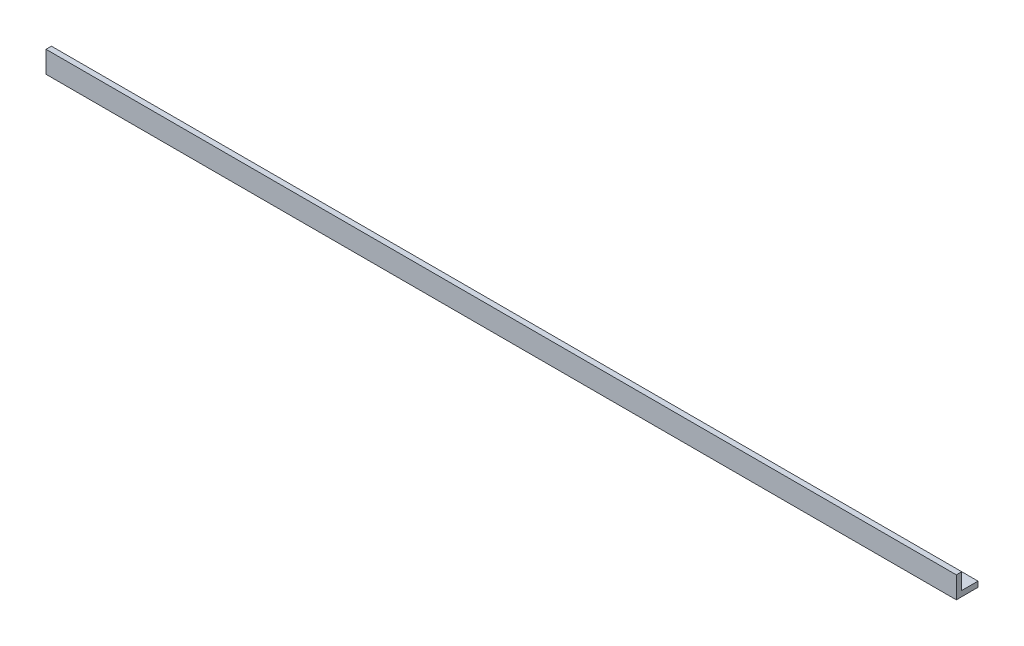
ISO-10303-21;
HEADER;
FILE_DESCRIPTION(('STEP AP214'),'2;1');
FILE_NAME('part.step','',(''),(''),'','','');
FILE_SCHEMA(('AUTOMOTIVE_DESIGN { 1 0 10303 214 1 1 1 1 }'));
ENDSEC;
DATA;
#1=APPLICATION_CONTEXT('core data for automotive mechanical design processes');
#2=APPLICATION_PROTOCOL_DEFINITION('international standard','automotive_design',2000,#1);
#3=PRODUCT_CONTEXT('',#1,'mechanical');
#4=PRODUCT('Part','Part','',(#3));
#5=PRODUCT_RELATED_PRODUCT_CATEGORY('part','',(#4));
#6=PRODUCT_DEFINITION_FORMATION('','',#4);
#7=PRODUCT_DEFINITION_CONTEXT('part definition',#1,'design');
#8=PRODUCT_DEFINITION('design','',#6,#7);
#9=PRODUCT_DEFINITION_SHAPE('','',#8);
#10=(LENGTH_UNIT() NAMED_UNIT(*) SI_UNIT(.MILLI.,.METRE.));
#11=(NAMED_UNIT(*) PLANE_ANGLE_UNIT() SI_UNIT($,.RADIAN.));
#12=(NAMED_UNIT(*) SI_UNIT($,.STERADIAN.) SOLID_ANGLE_UNIT());
#13=UNCERTAINTY_MEASURE_WITH_UNIT(LENGTH_MEASURE(1.E-05),#10,'distance_accuracy_value','');
#14=(GEOMETRIC_REPRESENTATION_CONTEXT(3) GLOBAL_UNCERTAINTY_ASSIGNED_CONTEXT((#13)) GLOBAL_UNIT_ASSIGNED_CONTEXT((#10,
#11,#12)) REPRESENTATION_CONTEXT('',''));
#15=CARTESIAN_POINT('',(0.,0.,0.));
#16=DIRECTION('',(0.,0.,1.));
#17=DIRECTION('',(1.,0.,0.));
#18=AXIS2_PLACEMENT_3D('',#15,#16,#17);
#19=CARTESIAN_POINT('',(-533.4,0.,-25.4));
#20=DIRECTION('',(0.,0.,1.));
#21=DIRECTION('',(1.,0.,0.));
#22=AXIS2_PLACEMENT_3D('',#19,#20,#21);
#23=PLANE('',#22);
#24=DIRECTION('',(1.,0.,0.));
#25=VECTOR('',#24,1.);
#26=CARTESIAN_POINT('',(-533.4,6.35,-25.4));
#27=LINE('',#26,#25);
#28=CARTESIAN_POINT('',(-533.4,6.35,-25.4));
#29=VERTEX_POINT('',#28);
#30=CARTESIAN_POINT('',(533.4,6.35,-25.4));
#31=VERTEX_POINT('',#30);
#32=EDGE_CURVE('E38',#29,#31,#27,.T.);
#33=ORIENTED_EDGE('',*,*,#32,.T.);
#34=DIRECTION('',(0.,-1.,0.));
#35=VECTOR('',#34,1.);
#36=CARTESIAN_POINT('',(533.4,0.,-25.4));
#37=LINE('',#36,#35);
#38=CARTESIAN_POINT('',(533.4,0.,-25.4));
#39=VERTEX_POINT('',#38);
#40=EDGE_CURVE('E90',#31,#39,#37,.T.);
#41=ORIENTED_EDGE('',*,*,#40,.T.);
#42=DIRECTION('',(1.,0.,0.));
#43=VECTOR('',#42,1.);
#44=CARTESIAN_POINT('',(-533.4,0.,-25.4));
#45=LINE('',#44,#43);
#46=CARTESIAN_POINT('',(-533.4,0.,-25.4));
#47=VERTEX_POINT('',#46);
#48=EDGE_CURVE('E11',#47,#39,#45,.T.);
#49=ORIENTED_EDGE('',*,*,#48,.F.);
#50=DIRECTION('',(0.,-1.,0.));
#51=VECTOR('',#50,1.);
#52=CARTESIAN_POINT('',(-533.4,0.,-25.4));
#53=LINE('',#52,#51);
#54=EDGE_CURVE('E51',#29,#47,#53,.T.);
#55=ORIENTED_EDGE('',*,*,#54,.F.);
#56=EDGE_LOOP('',(#33,#41,#49,#55));
#57=FACE_BOUND('',#56,.T.);
#58=ADVANCED_FACE('F35',(#57),#23,.F.);
#59=CARTESIAN_POINT('',(-533.4,0.,0.));
#60=DIRECTION('',(0.,-1.,0.));
#61=DIRECTION('',(0.,0.,-1.));
#62=AXIS2_PLACEMENT_3D('',#59,#60,#61);
#63=PLANE('',#62);
#64=ORIENTED_EDGE('',*,*,#48,.T.);
#65=DIRECTION('',(0.,0.,-1.));
#66=VECTOR('',#65,1.);
#67=CARTESIAN_POINT('',(533.4,0.,0.));
#68=LINE('',#67,#66);
#69=CARTESIAN_POINT('',(533.4,0.,0.));
#70=VERTEX_POINT('',#69);
#71=EDGE_CURVE('E104',#70,#39,#68,.T.);
#72=ORIENTED_EDGE('',*,*,#71,.F.);
#73=DIRECTION('',(1.,0.,0.));
#74=VECTOR('',#73,1.);
#75=CARTESIAN_POINT('',(-533.4,0.,0.));
#76=LINE('',#75,#74);
#77=CARTESIAN_POINT('',(-533.4,0.,0.));
#78=VERTEX_POINT('',#77);
#79=EDGE_CURVE('E43',#78,#70,#76,.T.);
#80=ORIENTED_EDGE('',*,*,#79,.F.);
#81=DIRECTION('',(0.,0.,-1.));
#82=VECTOR('',#81,1.);
#83=CARTESIAN_POINT('',(-533.4,0.,0.));
#84=LINE('',#83,#82);
#85=EDGE_CURVE('E95',#78,#47,#84,.T.);
#86=ORIENTED_EDGE('',*,*,#85,.T.);
#87=EDGE_LOOP('',(#64,#72,#80,#86));
#88=FACE_BOUND('',#87,.T.);
#89=ADVANCED_FACE('F144',(#88),#63,.T.);
#90=CARTESIAN_POINT('',(-533.4,0.,0.));
#91=DIRECTION('',(0.,0.,1.));
#92=DIRECTION('',(1.,0.,0.));
#93=AXIS2_PLACEMENT_3D('',#90,#91,#92);
#94=PLANE('',#93);
#95=ORIENTED_EDGE('',*,*,#79,.T.);
#96=DIRECTION('',(0.,-1.,0.));
#97=VECTOR('',#96,1.);
#98=CARTESIAN_POINT('',(533.4,0.,0.));
#99=LINE('',#98,#97);
#100=CARTESIAN_POINT('',(533.4,25.4,0.));
#101=VERTEX_POINT('',#100);
#102=EDGE_CURVE('E115',#101,#70,#99,.T.);
#103=ORIENTED_EDGE('',*,*,#102,.F.);
#104=DIRECTION('',(1.,0.,0.));
#105=VECTOR('',#104,1.);
#106=CARTESIAN_POINT('',(-533.4,25.4,0.));
#107=LINE('',#106,#105);
#108=CARTESIAN_POINT('',(-533.4,25.4,0.));
#109=VERTEX_POINT('',#108);
#110=EDGE_CURVE('E129',#109,#101,#107,.T.);
#111=ORIENTED_EDGE('',*,*,#110,.F.);
#112=DIRECTION('',(0.,-1.,0.));
#113=VECTOR('',#112,1.);
#114=CARTESIAN_POINT('',(-533.4,0.,0.));
#115=LINE('',#114,#113);
#116=EDGE_CURVE('E125',#109,#78,#115,.T.);
#117=ORIENTED_EDGE('',*,*,#116,.T.);
#118=EDGE_LOOP('',(#95,#103,#111,#117));
#119=FACE_BOUND('',#118,.T.);
#120=ADVANCED_FACE('F143',(#119),#94,.T.);
#121=CARTESIAN_POINT('',(-533.4,25.4,0.));
#122=DIRECTION('',(0.,-1.,0.));
#123=DIRECTION('',(0.,0.,-1.));
#124=AXIS2_PLACEMENT_3D('',#121,#122,#123);
#125=PLANE('',#124);
#126=ORIENTED_EDGE('',*,*,#110,.T.);
#127=DIRECTION('',(0.,0.,-1.));
#128=VECTOR('',#127,1.);
#129=CARTESIAN_POINT('',(533.4,25.4,0.));
#130=LINE('',#129,#128);
#131=CARTESIAN_POINT('',(533.4,25.4,-6.35));
#132=VERTEX_POINT('',#131);
#133=EDGE_CURVE('E110',#101,#132,#130,.T.);
#134=ORIENTED_EDGE('',*,*,#133,.T.);
#135=DIRECTION('',(1.,0.,0.));
#136=VECTOR('',#135,1.);
#137=CARTESIAN_POINT('',(-533.4,25.4,-6.35));
#138=LINE('',#137,#136);
#139=CARTESIAN_POINT('',(-533.4,25.4,-6.35));
#140=VERTEX_POINT('',#139);
#141=EDGE_CURVE('E131',#140,#132,#138,.T.);
#142=ORIENTED_EDGE('',*,*,#141,.F.);
#143=DIRECTION('',(0.,0.,-1.));
#144=VECTOR('',#143,1.);
#145=CARTESIAN_POINT('',(-533.4,25.4,0.));
#146=LINE('',#145,#144);
#147=EDGE_CURVE('E123',#109,#140,#146,.T.);
#148=ORIENTED_EDGE('',*,*,#147,.F.);
#149=EDGE_LOOP('',(#126,#134,#142,#148));
#150=FACE_BOUND('',#149,.T.);
#151=ADVANCED_FACE('F139',(#150),#125,.F.);
#152=CARTESIAN_POINT('',(-533.4,0.,-6.35));
#153=DIRECTION('',(0.,0.,1.));
#154=DIRECTION('',(1.,0.,0.));
#155=AXIS2_PLACEMENT_3D('',#152,#153,#154);
#156=PLANE('',#155);
#157=ORIENTED_EDGE('',*,*,#141,.T.);
#158=DIRECTION('',(0.,-1.,0.));
#159=VECTOR('',#158,1.);
#160=CARTESIAN_POINT('',(533.4,0.,-6.35));
#161=LINE('',#160,#159);
#162=CARTESIAN_POINT('',(533.4,6.35,-6.35));
#163=VERTEX_POINT('',#162);
#164=EDGE_CURVE('E108',#132,#163,#161,.T.);
#165=ORIENTED_EDGE('',*,*,#164,.T.);
#166=DIRECTION('',(1.,0.,0.));
#167=VECTOR('',#166,1.);
#168=CARTESIAN_POINT('',(-533.4,6.35,-6.35));
#169=LINE('',#168,#167);
#170=CARTESIAN_POINT('',(-533.4,6.35,-6.35));
#171=VERTEX_POINT('',#170);
#172=EDGE_CURVE('E94',#171,#163,#169,.T.);
#173=ORIENTED_EDGE('',*,*,#172,.F.);
#174=DIRECTION('',(0.,-1.,0.));
#175=VECTOR('',#174,1.);
#176=CARTESIAN_POINT('',(-533.4,0.,-6.35));
#177=LINE('',#176,#175);
#178=EDGE_CURVE('E121',#140,#171,#177,.T.);
#179=ORIENTED_EDGE('',*,*,#178,.F.);
#180=EDGE_LOOP('',(#157,#165,#173,#179));
#181=FACE_BOUND('',#180,.T.);
#182=ADVANCED_FACE('F135',(#181),#156,.F.);
#183=CARTESIAN_POINT('',(-533.4,6.35,0.));
#184=DIRECTION('',(0.,-1.,0.));
#185=DIRECTION('',(0.,0.,-1.));
#186=AXIS2_PLACEMENT_3D('',#183,#184,#185);
#187=PLANE('',#186);
#188=ORIENTED_EDGE('',*,*,#172,.T.);
#189=DIRECTION('',(0.,0.,-1.));
#190=VECTOR('',#189,1.);
#191=CARTESIAN_POINT('',(533.4,6.35,0.));
#192=LINE('',#191,#190);
#193=EDGE_CURVE('E101',#163,#31,#192,.T.);
#194=ORIENTED_EDGE('',*,*,#193,.T.);
#195=ORIENTED_EDGE('',*,*,#32,.F.);
#196=DIRECTION('',(0.,0.,-1.));
#197=VECTOR('',#196,1.);
#198=CARTESIAN_POINT('',(-533.4,6.35,0.));
#199=LINE('',#198,#197);
#200=EDGE_CURVE('E119',#171,#29,#199,.T.);
#201=ORIENTED_EDGE('',*,*,#200,.F.);
#202=EDGE_LOOP('',(#188,#194,#195,#201));
#203=FACE_BOUND('',#202,.T.);
#204=ADVANCED_FACE('F106',(#203),#187,.F.);
#205=CARTESIAN_POINT('',(-533.4,0.,0.));
#206=DIRECTION('',(1.,0.,0.));
#207=DIRECTION('',(0.,0.,-1.));
#208=AXIS2_PLACEMENT_3D('',#205,#206,#207);
#209=PLANE('',#208);
#210=ORIENTED_EDGE('',*,*,#54,.T.);
#211=ORIENTED_EDGE('',*,*,#85,.F.);
#212=ORIENTED_EDGE('',*,*,#116,.F.);
#213=ORIENTED_EDGE('',*,*,#147,.T.);
#214=ORIENTED_EDGE('',*,*,#178,.T.);
#215=ORIENTED_EDGE('',*,*,#200,.T.);
#216=EDGE_LOOP('',(#210,#211,#212,#213,#214,#215));
#217=FACE_BOUND('',#216,.T.);
#218=ADVANCED_FACE('F145',(#217),#209,.F.);
#219=CARTESIAN_POINT('',(533.4,0.,0.));
#220=DIRECTION('',(1.,0.,0.));
#221=DIRECTION('',(0.,0.,-1.));
#222=AXIS2_PLACEMENT_3D('',#219,#220,#221);
#223=PLANE('',#222);
#224=ORIENTED_EDGE('',*,*,#40,.F.);
#225=ORIENTED_EDGE('',*,*,#193,.F.);
#226=ORIENTED_EDGE('',*,*,#164,.F.);
#227=ORIENTED_EDGE('',*,*,#133,.F.);
#228=ORIENTED_EDGE('',*,*,#102,.T.);
#229=ORIENTED_EDGE('',*,*,#71,.T.);
#230=EDGE_LOOP('',(#224,#225,#226,#227,#228,#229));
#231=FACE_BOUND('',#230,.T.);
#232=ADVANCED_FACE('F99',(#231),#223,.T.);
#233=CLOSED_SHELL('',(#58,#89,#120,#151,#182,#204,#218,#232));
#234=MANIFOLD_SOLID_BREP('B2',#233);
#235=ADVANCED_BREP_SHAPE_REPRESENTATION('',(#18,#234),#14);
#236=SHAPE_DEFINITION_REPRESENTATION(#9,#235);
ENDSEC;
END-ISO-10303-21;
